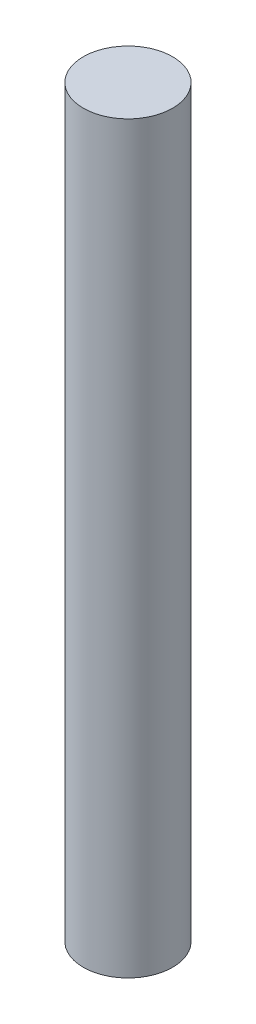
ISO-10303-21;
HEADER;
FILE_DESCRIPTION(('STEP AP214'),'2;1');
FILE_NAME('part.step','',(''),(''),'','','');
FILE_SCHEMA(('AUTOMOTIVE_DESIGN { 1 0 10303 214 1 1 1 1 }'));
ENDSEC;
DATA;
#1=APPLICATION_CONTEXT('core data for automotive mechanical design processes');
#2=APPLICATION_PROTOCOL_DEFINITION('international standard','automotive_design',2000,#1);
#3=PRODUCT_CONTEXT('',#1,'mechanical');
#4=PRODUCT('Part','Part','',(#3));
#5=PRODUCT_RELATED_PRODUCT_CATEGORY('part','',(#4));
#6=PRODUCT_DEFINITION_FORMATION('','',#4);
#7=PRODUCT_DEFINITION_CONTEXT('part definition',#1,'design');
#8=PRODUCT_DEFINITION('design','',#6,#7);
#9=PRODUCT_DEFINITION_SHAPE('','',#8);
#10=(LENGTH_UNIT() NAMED_UNIT(*) SI_UNIT(.MILLI.,.METRE.));
#11=(NAMED_UNIT(*) PLANE_ANGLE_UNIT() SI_UNIT($,.RADIAN.));
#12=(NAMED_UNIT(*) SI_UNIT($,.STERADIAN.) SOLID_ANGLE_UNIT());
#13=UNCERTAINTY_MEASURE_WITH_UNIT(LENGTH_MEASURE(1.E-05),#10,'distance_accuracy_value','');
#14=(GEOMETRIC_REPRESENTATION_CONTEXT(3) GLOBAL_UNCERTAINTY_ASSIGNED_CONTEXT((#13)) GLOBAL_UNIT_ASSIGNED_CONTEXT((#10,
#11,#12)) REPRESENTATION_CONTEXT('',''));
#15=CARTESIAN_POINT('',(0.,0.,0.));
#16=DIRECTION('',(0.,0.,1.));
#17=DIRECTION('',(1.,0.,0.));
#18=AXIS2_PLACEMENT_3D('',#15,#16,#17);
#19=CARTESIAN_POINT('',(0.,50.,0.));
#20=DIRECTION('',(0.,-1.,0.));
#21=DIRECTION('',(0.,0.,-1.));
#22=AXIS2_PLACEMENT_3D('',#19,#20,#21);
#23=CYLINDRICAL_SURFACE('',#22,3.);
#24=CARTESIAN_POINT('',(0.,50.,0.));
#25=DIRECTION('',(0.,1.,0.));
#26=DIRECTION('',(0.,0.,1.));
#27=AXIS2_PLACEMENT_3D('',#24,#25,#26);
#28=CIRCLE('',#27,3.);
#29=CARTESIAN_POINT('',(0.,50.,3.));
#30=VERTEX_POINT('',#29);
#31=EDGE_CURVE('E10',#30,#30,#28,.T.);
#32=ORIENTED_EDGE('',*,*,#31,.F.);
#33=EDGE_LOOP('',(#32));
#34=FACE_BOUND('',#33,.T.);
#35=CARTESIAN_POINT('',(0.,0.,0.));
#36=DIRECTION('',(0.,1.,0.));
#37=DIRECTION('',(0.,0.,1.));
#38=AXIS2_PLACEMENT_3D('',#35,#36,#37);
#39=CIRCLE('',#38,3.);
#40=CARTESIAN_POINT('',(0.,0.,3.));
#41=VERTEX_POINT('',#40);
#42=EDGE_CURVE('E34',#41,#41,#39,.T.);
#43=ORIENTED_EDGE('',*,*,#42,.T.);
#44=EDGE_LOOP('',(#43));
#45=FACE_BOUND('',#44,.T.);
#46=ADVANCED_FACE('F31',(#34,#45),#23,.T.);
#47=CARTESIAN_POINT('',(0.,50.,0.));
#48=DIRECTION('',(0.,1.,0.));
#49=DIRECTION('',(0.,0.,1.));
#50=AXIS2_PLACEMENT_3D('',#47,#48,#49);
#51=PLANE('',#50);
#52=ORIENTED_EDGE('',*,*,#31,.T.);
#53=EDGE_LOOP('',(#52));
#54=FACE_BOUND('',#53,.T.);
#55=ADVANCED_FACE('F46',(#54),#51,.T.);
#56=CARTESIAN_POINT('',(0.,0.,0.));
#57=DIRECTION('',(0.,1.,0.));
#58=DIRECTION('',(0.,0.,1.));
#59=AXIS2_PLACEMENT_3D('',#56,#57,#58);
#60=PLANE('',#59);
#61=ORIENTED_EDGE('',*,*,#42,.F.);
#62=EDGE_LOOP('',(#61));
#63=FACE_BOUND('',#62,.T.);
#64=ADVANCED_FACE('F44',(#63),#60,.F.);
#65=CLOSED_SHELL('',(#46,#55,#64));
#66=MANIFOLD_SOLID_BREP('B2',#65);
#67=ADVANCED_BREP_SHAPE_REPRESENTATION('',(#18,#66),#14);
#68=SHAPE_DEFINITION_REPRESENTATION(#9,#67);
ENDSEC;
END-ISO-10303-21;
